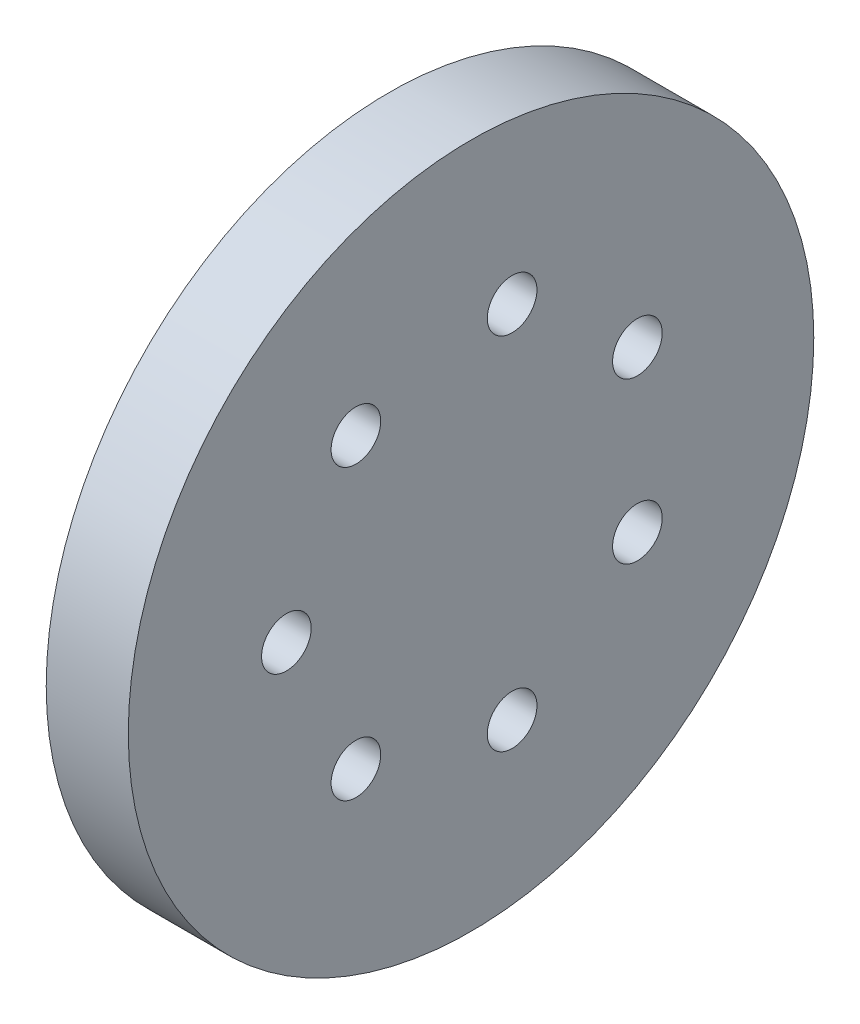
ISO-10303-21;
HEADER;
FILE_DESCRIPTION(('STEP AP214'),'2;1');
FILE_NAME('part.step','',(''),(''),'','','');
FILE_SCHEMA(('AUTOMOTIVE_DESIGN { 1 0 10303 214 1 1 1 1 }'));
ENDSEC;
DATA;
#1=APPLICATION_CONTEXT('core data for automotive mechanical design processes');
#2=APPLICATION_PROTOCOL_DEFINITION('international standard','automotive_design',2000,#1);
#3=PRODUCT_CONTEXT('',#1,'mechanical');
#4=PRODUCT('Part','Part','',(#3));
#5=PRODUCT_RELATED_PRODUCT_CATEGORY('part','',(#4));
#6=PRODUCT_DEFINITION_FORMATION('','',#4);
#7=PRODUCT_DEFINITION_CONTEXT('part definition',#1,'design');
#8=PRODUCT_DEFINITION('design','',#6,#7);
#9=PRODUCT_DEFINITION_SHAPE('','',#8);
#10=(LENGTH_UNIT() NAMED_UNIT(*) SI_UNIT(.MILLI.,.METRE.));
#11=(NAMED_UNIT(*) PLANE_ANGLE_UNIT() SI_UNIT($,.RADIAN.));
#12=(NAMED_UNIT(*) SI_UNIT($,.STERADIAN.) SOLID_ANGLE_UNIT());
#13=UNCERTAINTY_MEASURE_WITH_UNIT(LENGTH_MEASURE(1.E-05),#10,'distance_accuracy_value','');
#14=(GEOMETRIC_REPRESENTATION_CONTEXT(3) GLOBAL_UNCERTAINTY_ASSIGNED_CONTEXT((#13)) GLOBAL_UNIT_ASSIGNED_CONTEXT((#10,
#11,#12)) REPRESENTATION_CONTEXT('',''));
#15=CARTESIAN_POINT('',(0.,0.,0.));
#16=DIRECTION('',(0.,0.,1.));
#17=DIRECTION('',(1.,0.,0.));
#18=AXIS2_PLACEMENT_3D('',#15,#16,#17);
#19=CARTESIAN_POINT('',(0.75,0.,0.));
#20=DIRECTION('',(1.,0.,0.));
#21=DIRECTION('',(0.,1.,0.));
#22=AXIS2_PLACEMENT_3D('',#19,#20,#21);
#23=PLANE('',#22);
#24=CARTESIAN_POINT('',(0.75,0.,0.));
#25=DIRECTION('',(1.,0.,0.));
#26=DIRECTION('',(0.,0.,-1.));
#27=AXIS2_PLACEMENT_3D('',#24,#25,#26);
#28=CIRCLE('',#27,15.05);
#29=CARTESIAN_POINT('',(0.75,0.,-15.05));
#30=VERTEX_POINT('',#29);
#31=EDGE_CURVE('E11',#30,#30,#28,.T.);
#32=ORIENTED_EDGE('',*,*,#31,.F.);
#33=EDGE_LOOP('',(#32));
#34=FACE_BOUND('',#33,.T.);
#35=CARTESIAN_POINT('',(0.75,0.,11.25));
#36=DIRECTION('',(1.,0.,0.));
#37=DIRECTION('',(0.,0.,-1.));
#38=AXIS2_PLACEMENT_3D('',#35,#36,#37);
#39=CIRCLE('',#38,1.5125);
#40=CARTESIAN_POINT('',(0.75,0.,9.7375));
#41=VERTEX_POINT('',#40);
#42=EDGE_CURVE('E148',#41,#41,#39,.T.);
#43=ORIENTED_EDGE('',*,*,#42,.T.);
#44=EDGE_LOOP('',(#43));
#45=FACE_BOUND('',#44,.T.);
#46=CARTESIAN_POINT('',(0.75,-8.79560417776534,7.01426027091075));
#47=DIRECTION('',(1.,0.,0.));
#48=DIRECTION('',(0.,0.,-1.));
#49=AXIS2_PLACEMENT_3D('',#46,#47,#48);
#50=CIRCLE('',#49,1.5125);
#51=CARTESIAN_POINT('',(0.75,-8.79560417776534,5.50176027091075));
#52=VERTEX_POINT('',#51);
#53=EDGE_CURVE('E140',#52,#52,#50,.T.);
#54=ORIENTED_EDGE('',*,*,#53,.T.);
#55=EDGE_LOOP('',(#54));
#56=FACE_BOUND('',#55,.T.);
#57=CARTESIAN_POINT('',(0.75,-10.9679390120455,-2.50336050700853));
#58=DIRECTION('',(1.,0.,0.));
#59=DIRECTION('',(0.,0.,-1.));
#60=AXIS2_PLACEMENT_3D('',#57,#58,#59);
#61=CIRCLE('',#60,1.5125);
#62=CARTESIAN_POINT('',(0.75,-10.9679390120455,-4.01586050700853));
#63=VERTEX_POINT('',#62);
#64=EDGE_CURVE('E139',#63,#63,#61,.T.);
#65=ORIENTED_EDGE('',*,*,#64,.T.);
#66=EDGE_LOOP('',(#65));
#67=FACE_BOUND('',#66,.T.);
#68=CARTESIAN_POINT('',(0.75,-4.88119206507253,-10.1358997639022));
#69=DIRECTION('',(1.,0.,0.));
#70=DIRECTION('',(0.,0.,-1.));
#71=AXIS2_PLACEMENT_3D('',#68,#69,#70);
#72=CIRCLE('',#71,1.5125);
#73=CARTESIAN_POINT('',(0.75,-4.88119206507253,-11.6483997639022));
#74=VERTEX_POINT('',#73);
#75=EDGE_CURVE('E135',#74,#74,#72,.T.);
#76=ORIENTED_EDGE('',*,*,#75,.T.);
#77=EDGE_LOOP('',(#76));
#78=FACE_BOUND('',#77,.T.);
#79=CARTESIAN_POINT('',(0.75,4.88119206507253,-10.1358997639022));
#80=DIRECTION('',(1.,0.,0.));
#81=DIRECTION('',(0.,0.,-1.));
#82=AXIS2_PLACEMENT_3D('',#79,#80,#81);
#83=CIRCLE('',#82,1.5125);
#84=CARTESIAN_POINT('',(0.75,4.88119206507253,-11.6483997639022));
#85=VERTEX_POINT('',#84);
#86=EDGE_CURVE('E67',#85,#85,#83,.T.);
#87=ORIENTED_EDGE('',*,*,#86,.T.);
#88=EDGE_LOOP('',(#87));
#89=FACE_BOUND('',#88,.T.);
#90=CARTESIAN_POINT('',(0.75,10.9679390120455,-2.50336050700854));
#91=DIRECTION('',(1.,0.,0.));
#92=DIRECTION('',(0.,0.,-1.));
#93=AXIS2_PLACEMENT_3D('',#90,#91,#92);
#94=CIRCLE('',#93,1.5125);
#95=CARTESIAN_POINT('',(0.75,10.9679390120455,-4.01586050700854));
#96=VERTEX_POINT('',#95);
#97=EDGE_CURVE('E111',#96,#96,#94,.T.);
#98=ORIENTED_EDGE('',*,*,#97,.T.);
#99=EDGE_LOOP('',(#98));
#100=FACE_BOUND('',#99,.T.);
#101=CARTESIAN_POINT('',(0.75,8.79560417776534,7.01426027091075));
#102=DIRECTION('',(1.,0.,0.));
#103=DIRECTION('',(0.,0.,-1.));
#104=AXIS2_PLACEMENT_3D('',#101,#102,#103);
#105=CIRCLE('',#104,1.5125);
#106=CARTESIAN_POINT('',(0.75,8.79560417776534,5.50176027091075));
#107=VERTEX_POINT('',#106);
#108=EDGE_CURVE('E110',#107,#107,#105,.T.);
#109=ORIENTED_EDGE('',*,*,#108,.T.);
#110=EDGE_LOOP('',(#109));
#111=FACE_BOUND('',#110,.T.);
#112=ADVANCED_FACE('F16',(#34,#45,#56,#67,#78,#89,#100,#111),#23,.F.);
#113=CARTESIAN_POINT('',(0.75,0.,0.));
#114=DIRECTION('',(-1.,0.,0.));
#115=DIRECTION('',(0.,0.,1.));
#116=AXIS2_PLACEMENT_3D('',#113,#114,#115);
#117=CYLINDRICAL_SURFACE('',#116,15.05);
#118=CARTESIAN_POINT('',(0.,0.,0.));
#119=DIRECTION('',(1.,0.,0.));
#120=DIRECTION('',(0.,0.,-1.));
#121=AXIS2_PLACEMENT_3D('',#118,#119,#120);
#122=CIRCLE('',#121,15.05);
#123=CARTESIAN_POINT('',(0.,0.,-15.05));
#124=VERTEX_POINT('',#123);
#125=EDGE_CURVE('E27',#124,#124,#122,.T.);
#126=ORIENTED_EDGE('',*,*,#125,.F.);
#127=EDGE_LOOP('',(#126));
#128=FACE_BOUND('',#127,.T.);
#129=ORIENTED_EDGE('',*,*,#31,.T.);
#130=EDGE_LOOP('',(#129));
#131=FACE_BOUND('',#130,.T.);
#132=ADVANCED_FACE('F199',(#128,#131),#117,.F.);
#133=CARTESIAN_POINT('',(0.,0.,0.));
#134=DIRECTION('',(1.,0.,0.));
#135=DIRECTION('',(0.,1.,0.));
#136=AXIS2_PLACEMENT_3D('',#133,#134,#135);
#137=PLANE('',#136);
#138=CARTESIAN_POINT('',(0.,0.,0.));
#139=DIRECTION('',(1.,0.,0.));
#140=DIRECTION('',(0.,0.,-1.));
#141=AXIS2_PLACEMENT_3D('',#138,#139,#140);
#142=CIRCLE('',#141,20.882305);
#143=CARTESIAN_POINT('',(0.,0.,-20.882305));
#144=VERTEX_POINT('',#143);
#145=EDGE_CURVE('E129',#144,#144,#142,.T.);
#146=ORIENTED_EDGE('',*,*,#145,.F.);
#147=EDGE_LOOP('',(#146));
#148=FACE_BOUND('',#147,.T.);
#149=ORIENTED_EDGE('',*,*,#125,.T.);
#150=EDGE_LOOP('',(#149));
#151=FACE_BOUND('',#150,.T.);
#152=ADVANCED_FACE('F171',(#148,#151),#137,.F.);
#153=CARTESIAN_POINT('',(5.,0.,0.));
#154=DIRECTION('',(1.,0.,0.));
#155=DIRECTION('',(0.,1.,0.));
#156=AXIS2_PLACEMENT_3D('',#153,#154,#155);
#157=PLANE('',#156);
#158=CARTESIAN_POINT('',(5.,0.,11.25));
#159=DIRECTION('',(1.,0.,0.));
#160=DIRECTION('',(0.,0.,-1.));
#161=AXIS2_PLACEMENT_3D('',#158,#159,#160);
#162=CIRCLE('',#161,1.5125);
#163=CARTESIAN_POINT('',(5.,0.,9.7375));
#164=VERTEX_POINT('',#163);
#165=EDGE_CURVE('E20',#164,#164,#162,.T.);
#166=ORIENTED_EDGE('',*,*,#165,.F.);
#167=EDGE_LOOP('',(#166));
#168=FACE_BOUND('',#167,.T.);
#169=CARTESIAN_POINT('',(5.,-8.79560417776534,7.01426027091075));
#170=DIRECTION('',(1.,0.,0.));
#171=DIRECTION('',(0.,0.,-1.));
#172=AXIS2_PLACEMENT_3D('',#169,#170,#171);
#173=CIRCLE('',#172,1.5125);
#174=CARTESIAN_POINT('',(5.,-8.79560417776534,5.50176027091075));
#175=VERTEX_POINT('',#174);
#176=EDGE_CURVE('E136',#175,#175,#173,.T.);
#177=ORIENTED_EDGE('',*,*,#176,.F.);
#178=EDGE_LOOP('',(#177));
#179=FACE_BOUND('',#178,.T.);
#180=CARTESIAN_POINT('',(5.,-10.9679390120455,-2.50336050700853));
#181=DIRECTION('',(1.,0.,0.));
#182=DIRECTION('',(0.,0.,-1.));
#183=AXIS2_PLACEMENT_3D('',#180,#181,#182);
#184=CIRCLE('',#183,1.5125);
#185=CARTESIAN_POINT('',(5.,-10.9679390120455,-4.01586050700853));
#186=VERTEX_POINT('',#185);
#187=EDGE_CURVE('E144',#186,#186,#184,.T.);
#188=ORIENTED_EDGE('',*,*,#187,.F.);
#189=EDGE_LOOP('',(#188));
#190=FACE_BOUND('',#189,.T.);
#191=CARTESIAN_POINT('',(5.,-4.88119206507253,-10.1358997639022));
#192=DIRECTION('',(1.,0.,0.));
#193=DIRECTION('',(0.,0.,-1.));
#194=AXIS2_PLACEMENT_3D('',#191,#192,#193);
#195=CIRCLE('',#194,1.5125);
#196=CARTESIAN_POINT('',(5.,-4.88119206507253,-11.6483997639022));
#197=VERTEX_POINT('',#196);
#198=EDGE_CURVE('E132',#197,#197,#195,.T.);
#199=ORIENTED_EDGE('',*,*,#198,.F.);
#200=EDGE_LOOP('',(#199));
#201=FACE_BOUND('',#200,.T.);
#202=CARTESIAN_POINT('',(5.,4.88119206507253,-10.1358997639022));
#203=DIRECTION('',(1.,0.,0.));
#204=DIRECTION('',(0.,0.,-1.));
#205=AXIS2_PLACEMENT_3D('',#202,#203,#204);
#206=CIRCLE('',#205,1.5125);
#207=CARTESIAN_POINT('',(5.,4.88119206507253,-11.6483997639022));
#208=VERTEX_POINT('',#207);
#209=EDGE_CURVE('E53',#208,#208,#206,.T.);
#210=ORIENTED_EDGE('',*,*,#209,.F.);
#211=EDGE_LOOP('',(#210));
#212=FACE_BOUND('',#211,.T.);
#213=CARTESIAN_POINT('',(5.,10.9679390120455,-2.50336050700854));
#214=DIRECTION('',(1.,0.,0.));
#215=DIRECTION('',(0.,0.,-1.));
#216=AXIS2_PLACEMENT_3D('',#213,#214,#215);
#217=CIRCLE('',#216,1.5125);
#218=CARTESIAN_POINT('',(5.,10.9679390120455,-4.01586050700854));
#219=VERTEX_POINT('',#218);
#220=EDGE_CURVE('E105',#219,#219,#217,.T.);
#221=ORIENTED_EDGE('',*,*,#220,.F.);
#222=EDGE_LOOP('',(#221));
#223=FACE_BOUND('',#222,.T.);
#224=CARTESIAN_POINT('',(5.,8.79560417776534,7.01426027091075));
#225=DIRECTION('',(1.,0.,0.));
#226=DIRECTION('',(0.,0.,-1.));
#227=AXIS2_PLACEMENT_3D('',#224,#225,#226);
#228=CIRCLE('',#227,1.5125);
#229=CARTESIAN_POINT('',(5.,8.79560417776534,5.50176027091075));
#230=VERTEX_POINT('',#229);
#231=EDGE_CURVE('E118',#230,#230,#228,.T.);
#232=ORIENTED_EDGE('',*,*,#231,.F.);
#233=EDGE_LOOP('',(#232));
#234=FACE_BOUND('',#233,.T.);
#235=CARTESIAN_POINT('',(5.,0.,0.));
#236=DIRECTION('',(1.,0.,0.));
#237=DIRECTION('',(0.,0.,-1.));
#238=AXIS2_PLACEMENT_3D('',#235,#236,#237);
#239=CIRCLE('',#238,20.882305);
#240=CARTESIAN_POINT('',(5.,0.,-20.882305));
#241=VERTEX_POINT('',#240);
#242=EDGE_CURVE('E125',#241,#241,#239,.T.);
#243=ORIENTED_EDGE('',*,*,#242,.T.);
#244=EDGE_LOOP('',(#243));
#245=FACE_BOUND('',#244,.T.);
#246=ADVANCED_FACE('F168',(#168,#179,#190,#201,#212,#223,#234,#245),#157,.T.);
#247=CARTESIAN_POINT('',(5.,0.,11.25));
#248=DIRECTION('',(-1.,0.,0.));
#249=DIRECTION('',(0.,0.,1.));
#250=AXIS2_PLACEMENT_3D('',#247,#248,#249);
#251=CYLINDRICAL_SURFACE('',#250,1.5125);
#252=ORIENTED_EDGE('',*,*,#165,.T.);
#253=EDGE_LOOP('',(#252));
#254=FACE_BOUND('',#253,.T.);
#255=ORIENTED_EDGE('',*,*,#42,.F.);
#256=EDGE_LOOP('',(#255));
#257=FACE_BOUND('',#256,.T.);
#258=ADVANCED_FACE('F165',(#254,#257),#251,.F.);
#259=CARTESIAN_POINT('',(5.,0.,0.));
#260=DIRECTION('',(-1.,0.,0.));
#261=DIRECTION('',(0.,0.,1.));
#262=AXIS2_PLACEMENT_3D('',#259,#260,#261);
#263=CYLINDRICAL_SURFACE('',#262,20.882305);
#264=ORIENTED_EDGE('',*,*,#145,.T.);
#265=EDGE_LOOP('',(#264));
#266=FACE_BOUND('',#265,.T.);
#267=ORIENTED_EDGE('',*,*,#242,.F.);
#268=EDGE_LOOP('',(#267));
#269=FACE_BOUND('',#268,.T.);
#270=ADVANCED_FACE('F186',(#266,#269),#263,.T.);
#271=CARTESIAN_POINT('',(5.,8.79560417776534,7.01426027091075));
#272=DIRECTION('',(-1.,0.,0.));
#273=DIRECTION('',(0.,0.,1.));
#274=AXIS2_PLACEMENT_3D('',#271,#272,#273);
#275=CYLINDRICAL_SURFACE('',#274,1.5125);
#276=ORIENTED_EDGE('',*,*,#231,.T.);
#277=EDGE_LOOP('',(#276));
#278=FACE_BOUND('',#277,.T.);
#279=ORIENTED_EDGE('',*,*,#108,.F.);
#280=EDGE_LOOP('',(#279));
#281=FACE_BOUND('',#280,.T.);
#282=ADVANCED_FACE('F188',(#278,#281),#275,.F.);
#283=CARTESIAN_POINT('',(5.,10.9679390120455,-2.50336050700854));
#284=DIRECTION('',(-1.,0.,0.));
#285=DIRECTION('',(0.,0.,1.));
#286=AXIS2_PLACEMENT_3D('',#283,#284,#285);
#287=CYLINDRICAL_SURFACE('',#286,1.5125);
#288=ORIENTED_EDGE('',*,*,#220,.T.);
#289=EDGE_LOOP('',(#288));
#290=FACE_BOUND('',#289,.T.);
#291=ORIENTED_EDGE('',*,*,#97,.F.);
#292=EDGE_LOOP('',(#291));
#293=FACE_BOUND('',#292,.T.);
#294=ADVANCED_FACE('F106',(#290,#293),#287,.F.);
#295=CARTESIAN_POINT('',(5.,4.88119206507253,-10.1358997639022));
#296=DIRECTION('',(-1.,0.,0.));
#297=DIRECTION('',(0.,0.,1.));
#298=AXIS2_PLACEMENT_3D('',#295,#296,#297);
#299=CYLINDRICAL_SURFACE('',#298,1.5125);
#300=ORIENTED_EDGE('',*,*,#209,.T.);
#301=EDGE_LOOP('',(#300));
#302=FACE_BOUND('',#301,.T.);
#303=ORIENTED_EDGE('',*,*,#86,.F.);
#304=EDGE_LOOP('',(#303));
#305=FACE_BOUND('',#304,.T.);
#306=ADVANCED_FACE('F212',(#302,#305),#299,.F.);
#307=CARTESIAN_POINT('',(5.,-4.88119206507253,-10.1358997639022));
#308=DIRECTION('',(-1.,0.,0.));
#309=DIRECTION('',(0.,0.,1.));
#310=AXIS2_PLACEMENT_3D('',#307,#308,#309);
#311=CYLINDRICAL_SURFACE('',#310,1.5125);
#312=ORIENTED_EDGE('',*,*,#198,.T.);
#313=EDGE_LOOP('',(#312));
#314=FACE_BOUND('',#313,.T.);
#315=ORIENTED_EDGE('',*,*,#75,.F.);
#316=EDGE_LOOP('',(#315));
#317=FACE_BOUND('',#316,.T.);
#318=ADVANCED_FACE('F209',(#314,#317),#311,.F.);
#319=CARTESIAN_POINT('',(5.,-10.9679390120455,-2.50336050700853));
#320=DIRECTION('',(-1.,0.,0.));
#321=DIRECTION('',(0.,0.,1.));
#322=AXIS2_PLACEMENT_3D('',#319,#320,#321);
#323=CYLINDRICAL_SURFACE('',#322,1.5125);
#324=ORIENTED_EDGE('',*,*,#187,.T.);
#325=EDGE_LOOP('',(#324));
#326=FACE_BOUND('',#325,.T.);
#327=ORIENTED_EDGE('',*,*,#64,.F.);
#328=EDGE_LOOP('',(#327));
#329=FACE_BOUND('',#328,.T.);
#330=ADVANCED_FACE('F211',(#326,#329),#323,.F.);
#331=CARTESIAN_POINT('',(5.,-8.79560417776534,7.01426027091075));
#332=DIRECTION('',(-1.,0.,0.));
#333=DIRECTION('',(0.,0.,1.));
#334=AXIS2_PLACEMENT_3D('',#331,#332,#333);
#335=CYLINDRICAL_SURFACE('',#334,1.5125);
#336=ORIENTED_EDGE('',*,*,#176,.T.);
#337=EDGE_LOOP('',(#336));
#338=FACE_BOUND('',#337,.T.);
#339=ORIENTED_EDGE('',*,*,#53,.F.);
#340=EDGE_LOOP('',(#339));
#341=FACE_BOUND('',#340,.T.);
#342=ADVANCED_FACE('F18',(#338,#341),#335,.F.);
#343=CLOSED_SHELL('',(#112,#132,#152,#246,#258,#270,#282,#294,#306,#318,#330,#342));
#344=MANIFOLD_SOLID_BREP('B1',#343);
#345=ADVANCED_BREP_SHAPE_REPRESENTATION('',(#18,#344),#14);
#346=SHAPE_DEFINITION_REPRESENTATION(#9,#345);
ENDSEC;
END-ISO-10303-21;
